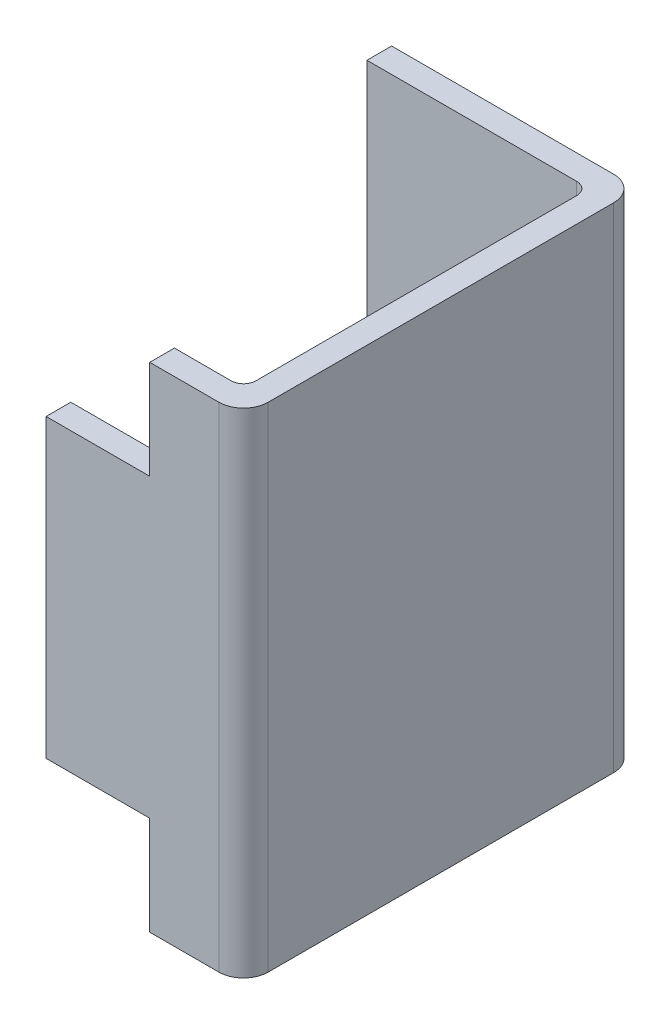
ISO-10303-21;
HEADER;
FILE_DESCRIPTION(('STEP AP214'),'2;1');
FILE_NAME('part.step','',(''),(''),'','','');
FILE_SCHEMA(('AUTOMOTIVE_DESIGN { 1 0 10303 214 1 1 1 1 }'));
ENDSEC;
DATA;
#1=APPLICATION_CONTEXT('core data for automotive mechanical design processes');
#2=APPLICATION_PROTOCOL_DEFINITION('international standard','automotive_design',2000,#1);
#3=PRODUCT_CONTEXT('',#1,'mechanical');
#4=PRODUCT('Part','Part','',(#3));
#5=PRODUCT_RELATED_PRODUCT_CATEGORY('part','',(#4));
#6=PRODUCT_DEFINITION_FORMATION('','',#4);
#7=PRODUCT_DEFINITION_CONTEXT('part definition',#1,'design');
#8=PRODUCT_DEFINITION('design','',#6,#7);
#9=PRODUCT_DEFINITION_SHAPE('','',#8);
#10=(LENGTH_UNIT() NAMED_UNIT(*) SI_UNIT(.MILLI.,.METRE.));
#11=(NAMED_UNIT(*) PLANE_ANGLE_UNIT() SI_UNIT($,.RADIAN.));
#12=(NAMED_UNIT(*) SI_UNIT($,.STERADIAN.) SOLID_ANGLE_UNIT());
#13=UNCERTAINTY_MEASURE_WITH_UNIT(LENGTH_MEASURE(1.E-05),#10,'distance_accuracy_value','');
#14=(GEOMETRIC_REPRESENTATION_CONTEXT(3) GLOBAL_UNCERTAINTY_ASSIGNED_CONTEXT((#13)) GLOBAL_UNIT_ASSIGNED_CONTEXT((#10,
#11,#12)) REPRESENTATION_CONTEXT('',''));
#15=CARTESIAN_POINT('',(0.,0.,0.));
#16=DIRECTION('',(0.,0.,1.));
#17=DIRECTION('',(1.,0.,0.));
#18=AXIS2_PLACEMENT_3D('',#15,#16,#17);
#19=CARTESIAN_POINT('',(0.475,0.,0.));
#20=DIRECTION('',(0.,0.,-1.));
#21=DIRECTION('',(-1.,0.,0.));
#22=AXIS2_PLACEMENT_3D('',#19,#20,#21);
#23=PLANE('',#22);
#24=DIRECTION('',(0.,1.,0.));
#25=VECTOR('',#24,1.);
#26=CARTESIAN_POINT('',(0.25,0.,0.));
#27=LINE('',#26,#25);
#28=CARTESIAN_POINT('',(0.25,-0.25,0.));
#29=VERTEX_POINT('',#28);
#30=CARTESIAN_POINT('',(0.25,0.25,0.));
#31=VERTEX_POINT('',#30);
#32=EDGE_CURVE('E11',#29,#31,#27,.T.);
#33=ORIENTED_EDGE('',*,*,#32,.T.);
#34=DIRECTION('',(-1.,0.,0.));
#35=VECTOR('',#34,1.);
#36=CARTESIAN_POINT('',(0.475,0.25,0.));
#37=LINE('',#36,#35);
#38=CARTESIAN_POINT('',(0.475,0.25,0.));
#39=VERTEX_POINT('',#38);
#40=EDGE_CURVE('E24',#39,#31,#37,.T.);
#41=ORIENTED_EDGE('',*,*,#40,.F.);
#42=DIRECTION('',(0.,-1.,0.));
#43=VECTOR('',#42,1.);
#44=CARTESIAN_POINT('',(0.475,0.,0.));
#45=LINE('',#44,#43);
#46=CARTESIAN_POINT('',(0.475,-0.25,0.));
#47=VERTEX_POINT('',#46);
#48=EDGE_CURVE('E259',#39,#47,#45,.T.);
#49=ORIENTED_EDGE('',*,*,#48,.T.);
#50=DIRECTION('',(1.,0.,0.));
#51=VECTOR('',#50,1.);
#52=CARTESIAN_POINT('',(0.475,-0.25,0.));
#53=LINE('',#52,#51);
#54=EDGE_CURVE('E256',#29,#47,#53,.T.);
#55=ORIENTED_EDGE('',*,*,#54,.F.);
#56=EDGE_LOOP('',(#33,#41,#49,#55));
#57=FACE_BOUND('',#56,.T.);
#58=ADVANCED_FACE('F17',(#57),#23,.T.);
#59=CARTESIAN_POINT('',(0.25,0.,0.));
#60=DIRECTION('',(-1.,0.,0.));
#61=DIRECTION('',(0.,0.,1.));
#62=AXIS2_PLACEMENT_3D('',#59,#60,#61);
#63=PLANE('',#62);
#64=DIRECTION('',(0.,1.,0.));
#65=VECTOR('',#64,1.);
#66=CARTESIAN_POINT('',(0.25,0.,0.0250000000116414));
#67=LINE('',#66,#65);
#68=CARTESIAN_POINT('',(0.25,-0.25,0.0250000000116414));
#69=VERTEX_POINT('',#68);
#70=CARTESIAN_POINT('',(0.25,0.25,0.0250000000116414));
#71=VERTEX_POINT('',#70);
#72=EDGE_CURVE('E254',#69,#71,#67,.T.);
#73=ORIENTED_EDGE('',*,*,#72,.T.);
#74=DIRECTION('',(0.,0.,1.));
#75=VECTOR('',#74,1.);
#76=CARTESIAN_POINT('',(0.25,0.25,0.));
#77=LINE('',#76,#75);
#78=EDGE_CURVE('E251',#31,#71,#77,.T.);
#79=ORIENTED_EDGE('',*,*,#78,.F.);
#80=ORIENTED_EDGE('',*,*,#32,.F.);
#81=DIRECTION('',(0.,0.,-1.));
#82=VECTOR('',#81,1.);
#83=CARTESIAN_POINT('',(0.25,-0.25,0.));
#84=LINE('',#83,#82);
#85=EDGE_CURVE('E248',#69,#29,#84,.T.);
#86=ORIENTED_EDGE('',*,*,#85,.F.);
#87=EDGE_LOOP('',(#73,#79,#80,#86));
#88=FACE_BOUND('',#87,.T.);
#89=ADVANCED_FACE('F265',(#88),#63,.T.);
#90=CARTESIAN_POINT('',(0.25,0.,0.0250000000116414));
#91=DIRECTION('',(0.,0.,1.));
#92=DIRECTION('',(1.,0.,0.));
#93=AXIS2_PLACEMENT_3D('',#90,#91,#92);
#94=PLANE('',#93);
#95=DIRECTION('',(0.,1.,0.));
#96=VECTOR('',#95,1.);
#97=CARTESIAN_POINT('',(0.46250000000291,0.,0.0250000000116413));
#98=LINE('',#97,#96);
#99=CARTESIAN_POINT('',(0.46250000000291,-0.25,0.0250000000116413));
#100=VERTEX_POINT('',#99);
#101=CARTESIAN_POINT('',(0.46250000000291,0.25,0.0250000000116413));
#102=VERTEX_POINT('',#101);
#103=EDGE_CURVE('E246',#100,#102,#98,.T.);
#104=ORIENTED_EDGE('',*,*,#103,.T.);
#105=DIRECTION('',(1.,0.,0.));
#106=VECTOR('',#105,1.);
#107=CARTESIAN_POINT('',(0.25,0.25,0.0250000000116414));
#108=LINE('',#107,#106);
#109=EDGE_CURVE('E243',#71,#102,#108,.T.);
#110=ORIENTED_EDGE('',*,*,#109,.F.);
#111=ORIENTED_EDGE('',*,*,#72,.F.);
#112=DIRECTION('',(-1.,0.,0.));
#113=VECTOR('',#112,1.);
#114=CARTESIAN_POINT('',(0.25,-0.25,0.0250000000116414));
#115=LINE('',#114,#113);
#116=EDGE_CURVE('E240',#100,#69,#115,.T.);
#117=ORIENTED_EDGE('',*,*,#116,.F.);
#118=EDGE_LOOP('',(#104,#110,#111,#117));
#119=FACE_BOUND('',#118,.T.);
#120=ADVANCED_FACE('F268',(#119),#94,.T.);
#121=CARTESIAN_POINT('',(0.46250000000291,0.,0.0375000000116413));
#122=DIRECTION('',(0.,1.,0.));
#123=DIRECTION('',(-1.,0.,0.));
#124=AXIS2_PLACEMENT_3D('',#121,#122,#123);
#125=CYLINDRICAL_SURFACE('',#124,0.0125);
#126=DIRECTION('',(0.,1.,0.));
#127=VECTOR('',#126,1.);
#128=CARTESIAN_POINT('',(0.47500000000291,0.,0.0375000000116413));
#129=LINE('',#128,#127);
#130=CARTESIAN_POINT('',(0.47500000000291,-0.25,0.0375000000116413));
#131=VERTEX_POINT('',#130);
#132=CARTESIAN_POINT('',(0.47500000000291,0.25,0.0375000000116413));
#133=VERTEX_POINT('',#132);
#134=EDGE_CURVE('E237',#131,#133,#129,.T.);
#135=ORIENTED_EDGE('',*,*,#134,.T.);
#136=CARTESIAN_POINT('',(0.46250000000291,0.25,0.0375000000116413));
#137=DIRECTION('',(0.,-1.,0.));
#138=DIRECTION('',(-1.,0.,0.));
#139=AXIS2_PLACEMENT_3D('',#136,#137,#138);
#140=CIRCLE('',#139,0.0125);
#141=EDGE_CURVE('E235',#102,#133,#140,.T.);
#142=ORIENTED_EDGE('',*,*,#141,.F.);
#143=ORIENTED_EDGE('',*,*,#103,.F.);
#144=CARTESIAN_POINT('',(0.46250000000291,-0.25,0.0375000000116413));
#145=DIRECTION('',(0.,1.,0.));
#146=DIRECTION('',(-1.,0.,0.));
#147=AXIS2_PLACEMENT_3D('',#144,#145,#146);
#148=CIRCLE('',#147,0.0125);
#149=EDGE_CURVE('E232',#131,#100,#148,.T.);
#150=ORIENTED_EDGE('',*,*,#149,.F.);
#151=EDGE_LOOP('',(#135,#142,#143,#150));
#152=FACE_BOUND('',#151,.T.);
#153=ADVANCED_FACE('F271',(#152),#125,.F.);
#154=CARTESIAN_POINT('',(0.47500000000291,0.,0.0375000000116413));
#155=DIRECTION('',(-1.,0.,0.));
#156=DIRECTION('',(0.,0.,1.));
#157=AXIS2_PLACEMENT_3D('',#154,#155,#156);
#158=PLANE('',#157);
#159=DIRECTION('',(0.,1.,0.));
#160=VECTOR('',#159,1.);
#161=CARTESIAN_POINT('',(0.475000000002911,0.,0.362500000029104));
#162=LINE('',#161,#160);
#163=CARTESIAN_POINT('',(0.475000000002911,-0.25,0.362500000029104));
#164=VERTEX_POINT('',#163);
#165=CARTESIAN_POINT('',(0.475000000002911,0.25,0.362500000029104));
#166=VERTEX_POINT('',#165);
#167=EDGE_CURVE('E230',#164,#166,#162,.T.);
#168=ORIENTED_EDGE('',*,*,#167,.T.);
#169=DIRECTION('',(0.,0.,1.));
#170=VECTOR('',#169,1.);
#171=CARTESIAN_POINT('',(0.47500000000291,0.25,0.0375000000116413));
#172=LINE('',#171,#170);
#173=EDGE_CURVE('E227',#133,#166,#172,.T.);
#174=ORIENTED_EDGE('',*,*,#173,.F.);
#175=ORIENTED_EDGE('',*,*,#134,.F.);
#176=DIRECTION('',(0.,0.,-1.));
#177=VECTOR('',#176,1.);
#178=CARTESIAN_POINT('',(0.47500000000291,-0.25,0.0375000000116413));
#179=LINE('',#178,#177);
#180=EDGE_CURVE('E224',#164,#131,#179,.T.);
#181=ORIENTED_EDGE('',*,*,#180,.F.);
#182=EDGE_LOOP('',(#168,#174,#175,#181));
#183=FACE_BOUND('',#182,.T.);
#184=ADVANCED_FACE('F276',(#183),#158,.T.);
#185=CARTESIAN_POINT('',(0.46250000000291,0.,0.362500000029104));
#186=DIRECTION('',(0.,1.,0.));
#187=DIRECTION('',(0.,0.,-1.));
#188=AXIS2_PLACEMENT_3D('',#185,#186,#187);
#189=CYLINDRICAL_SURFACE('',#188,0.0125);
#190=DIRECTION('',(0.,1.,0.));
#191=VECTOR('',#190,1.);
#192=CARTESIAN_POINT('',(0.46250000000291,0.,0.375000000029104));
#193=LINE('',#192,#191);
#194=CARTESIAN_POINT('',(0.46250000000291,-0.25,0.375000000029104));
#195=VERTEX_POINT('',#194);
#196=CARTESIAN_POINT('',(0.46250000000291,0.25,0.375000000029104));
#197=VERTEX_POINT('',#196);
#198=EDGE_CURVE('E221',#195,#197,#193,.T.);
#199=ORIENTED_EDGE('',*,*,#198,.T.);
#200=CARTESIAN_POINT('',(0.46250000000291,0.25,0.362500000029104));
#201=DIRECTION('',(0.,-1.,0.));
#202=DIRECTION('',(0.,0.,-1.));
#203=AXIS2_PLACEMENT_3D('',#200,#201,#202);
#204=CIRCLE('',#203,0.0125);
#205=EDGE_CURVE('E219',#166,#197,#204,.T.);
#206=ORIENTED_EDGE('',*,*,#205,.F.);
#207=ORIENTED_EDGE('',*,*,#167,.F.);
#208=CARTESIAN_POINT('',(0.46250000000291,-0.25,0.362500000029104));
#209=DIRECTION('',(0.,1.,0.));
#210=DIRECTION('',(0.,0.,-1.));
#211=AXIS2_PLACEMENT_3D('',#208,#209,#210);
#212=CIRCLE('',#211,0.0125);
#213=EDGE_CURVE('E216',#195,#164,#212,.T.);
#214=ORIENTED_EDGE('',*,*,#213,.F.);
#215=EDGE_LOOP('',(#199,#206,#207,#214));
#216=FACE_BOUND('',#215,.T.);
#217=ADVANCED_FACE('F279',(#216),#189,.F.);
#218=CARTESIAN_POINT('',(0.475,0.,0.375));
#219=DIRECTION('',(0.,1.,0.));
#220=DIRECTION('',(0.,0.,1.));
#221=AXIS2_PLACEMENT_3D('',#218,#219,#220);
#222=CYLINDRICAL_SURFACE('',#221,0.0250000000000002);
#223=DIRECTION('',(0.,1.,0.));
#224=VECTOR('',#223,1.);
#225=CARTESIAN_POINT('',(0.5,0.,0.375));
#226=LINE('',#225,#224);
#227=CARTESIAN_POINT('',(0.5,-0.25,0.375));
#228=VERTEX_POINT('',#227);
#229=CARTESIAN_POINT('',(0.5,0.25,0.375));
#230=VERTEX_POINT('',#229);
#231=EDGE_CURVE('E214',#228,#230,#226,.T.);
#232=ORIENTED_EDGE('',*,*,#231,.T.);
#233=CARTESIAN_POINT('',(0.475,0.25,0.375));
#234=DIRECTION('',(0.,1.,0.));
#235=DIRECTION('',(0.,0.,1.));
#236=AXIS2_PLACEMENT_3D('',#233,#234,#235);
#237=CIRCLE('',#236,0.0250000000000002);
#238=CARTESIAN_POINT('',(0.475,0.25,0.4));
#239=VERTEX_POINT('',#238);
#240=EDGE_CURVE('E211',#239,#230,#237,.T.);
#241=ORIENTED_EDGE('',*,*,#240,.F.);
#242=DIRECTION('',(0.,1.,0.));
#243=VECTOR('',#242,1.);
#244=CARTESIAN_POINT('',(0.475,0.,0.4));
#245=LINE('',#244,#243);
#246=CARTESIAN_POINT('',(0.475,-0.25,0.4));
#247=VERTEX_POINT('',#246);
#248=EDGE_CURVE('E208',#247,#239,#245,.T.);
#249=ORIENTED_EDGE('',*,*,#248,.F.);
#250=CARTESIAN_POINT('',(0.475,-0.25,0.375));
#251=DIRECTION('',(0.,-1.,0.));
#252=DIRECTION('',(0.,0.,1.));
#253=AXIS2_PLACEMENT_3D('',#250,#251,#252);
#254=CIRCLE('',#253,0.0250000000000002);
#255=EDGE_CURVE('E205',#228,#247,#254,.T.);
#256=ORIENTED_EDGE('',*,*,#255,.F.);
#257=EDGE_LOOP('',(#232,#241,#249,#256));
#258=FACE_BOUND('',#257,.T.);
#259=ADVANCED_FACE('F301',(#258),#222,.T.);
#260=CARTESIAN_POINT('',(0.5,0.,0.375));
#261=DIRECTION('',(1.,0.,0.));
#262=DIRECTION('',(0.,0.,-1.));
#263=AXIS2_PLACEMENT_3D('',#260,#261,#262);
#264=PLANE('',#263);
#265=DIRECTION('',(0.,1.,0.));
#266=VECTOR('',#265,1.);
#267=CARTESIAN_POINT('',(0.5,0.,0.0249999999999997));
#268=LINE('',#267,#266);
#269=CARTESIAN_POINT('',(0.5,-0.25,0.0249999999999997));
#270=VERTEX_POINT('',#269);
#271=CARTESIAN_POINT('',(0.5,0.25,0.0249999999999997));
#272=VERTEX_POINT('',#271);
#273=EDGE_CURVE('E203',#270,#272,#268,.T.);
#274=ORIENTED_EDGE('',*,*,#273,.T.);
#275=DIRECTION('',(0.,0.,-1.));
#276=VECTOR('',#275,1.);
#277=CARTESIAN_POINT('',(0.5,0.25,0.375));
#278=LINE('',#277,#276);
#279=EDGE_CURVE('E200',#230,#272,#278,.T.);
#280=ORIENTED_EDGE('',*,*,#279,.F.);
#281=ORIENTED_EDGE('',*,*,#231,.F.);
#282=DIRECTION('',(0.,0.,1.));
#283=VECTOR('',#282,1.);
#284=CARTESIAN_POINT('',(0.5,-0.25,0.375));
#285=LINE('',#284,#283);
#286=EDGE_CURVE('E197',#270,#228,#285,.T.);
#287=ORIENTED_EDGE('',*,*,#286,.F.);
#288=EDGE_LOOP('',(#274,#280,#281,#287));
#289=FACE_BOUND('',#288,.T.);
#290=ADVANCED_FACE('F304',(#289),#264,.T.);
#291=CARTESIAN_POINT('',(0.475,0.,0.0249999999999998));
#292=DIRECTION('',(0.,1.,0.));
#293=DIRECTION('',(1.,0.,0.));
#294=AXIS2_PLACEMENT_3D('',#291,#292,#293);
#295=CYLINDRICAL_SURFACE('',#294,0.0249999999999999);
#296=ORIENTED_EDGE('',*,*,#48,.F.);
#297=CARTESIAN_POINT('',(0.475,0.25,0.0249999999999998));
#298=DIRECTION('',(0.,1.,0.));
#299=DIRECTION('',(1.,0.,0.));
#300=AXIS2_PLACEMENT_3D('',#297,#298,#299);
#301=CIRCLE('',#300,0.0249999999999999);
#302=EDGE_CURVE('E194',#272,#39,#301,.T.);
#303=ORIENTED_EDGE('',*,*,#302,.F.);
#304=ORIENTED_EDGE('',*,*,#273,.F.);
#305=CARTESIAN_POINT('',(0.475,-0.25,0.0249999999999998));
#306=DIRECTION('',(0.,-1.,0.));
#307=DIRECTION('',(1.,0.,0.));
#308=AXIS2_PLACEMENT_3D('',#305,#306,#307);
#309=CIRCLE('',#308,0.0249999999999999);
#310=EDGE_CURVE('E191',#47,#270,#309,.T.);
#311=ORIENTED_EDGE('',*,*,#310,.F.);
#312=EDGE_LOOP('',(#296,#303,#304,#311));
#313=FACE_BOUND('',#312,.T.);
#314=ADVANCED_FACE('F307',(#313),#295,.T.);
#315=CARTESIAN_POINT('',(0.375,-0.25,0.2));
#316=DIRECTION('',(0.,1.,0.));
#317=DIRECTION('',(0.,0.,1.));
#318=AXIS2_PLACEMENT_3D('',#315,#316,#317);
#319=PLANE('',#318);
#320=DIRECTION('',(0.,0.,-1.));
#321=VECTOR('',#320,1.);
#322=CARTESIAN_POINT('',(0.404981821047639,-0.25,0.3));
#323=LINE('',#322,#321);
#324=CARTESIAN_POINT('',(0.404981821047639,-0.25,0.4));
#325=VERTEX_POINT('',#324);
#326=CARTESIAN_POINT('',(0.404981821047639,-0.25,0.375));
#327=VERTEX_POINT('',#326);
#328=EDGE_CURVE('E189',#325,#327,#323,.T.);
#329=ORIENTED_EDGE('',*,*,#328,.T.);
#330=DIRECTION('',(1.,0.,0.));
#331=VECTOR('',#330,1.);
#332=CARTESIAN_POINT('',(0.46250000000291,-0.25,0.375000000029104));
#333=LINE('',#332,#331);
#334=EDGE_CURVE('E134',#327,#195,#333,.T.);
#335=ORIENTED_EDGE('',*,*,#334,.T.);
#336=ORIENTED_EDGE('',*,*,#213,.T.);
#337=ORIENTED_EDGE('',*,*,#180,.T.);
#338=ORIENTED_EDGE('',*,*,#149,.T.);
#339=ORIENTED_EDGE('',*,*,#116,.T.);
#340=ORIENTED_EDGE('',*,*,#85,.T.);
#341=ORIENTED_EDGE('',*,*,#54,.T.);
#342=ORIENTED_EDGE('',*,*,#310,.T.);
#343=ORIENTED_EDGE('',*,*,#286,.T.);
#344=ORIENTED_EDGE('',*,*,#255,.T.);
#345=DIRECTION('',(-1.,0.,0.));
#346=VECTOR('',#345,1.);
#347=CARTESIAN_POINT('',(0.3,-0.25,0.4));
#348=LINE('',#347,#346);
#349=EDGE_CURVE('E185',#247,#325,#348,.T.);
#350=ORIENTED_EDGE('',*,*,#349,.T.);
#351=EDGE_LOOP('',(#329,#335,#336,#337,#338,#339,#340,#341,#342,#343,#344,#350));
#352=FACE_BOUND('',#351,.T.);
#353=ADVANCED_FACE('F297',(#352),#319,.F.);
#354=CARTESIAN_POINT('',(0.3,0.,0.4));
#355=DIRECTION('',(0.,0.,1.));
#356=DIRECTION('',(1.,0.,0.));
#357=AXIS2_PLACEMENT_3D('',#354,#355,#356);
#358=PLANE('',#357);
#359=DIRECTION('',(0.,-1.,0.));
#360=VECTOR('',#359,1.);
#361=CARTESIAN_POINT('',(0.404981821047639,-0.175,0.4));
#362=LINE('',#361,#360);
#363=CARTESIAN_POINT('',(0.404981821047639,-0.15,0.4));
#364=VERTEX_POINT('',#363);
#365=EDGE_CURVE('E150',#364,#325,#362,.T.);
#366=ORIENTED_EDGE('',*,*,#365,.T.);
#367=ORIENTED_EDGE('',*,*,#349,.F.);
#368=ORIENTED_EDGE('',*,*,#248,.T.);
#369=DIRECTION('',(1.,0.,0.));
#370=VECTOR('',#369,1.);
#371=CARTESIAN_POINT('',(0.3,0.25,0.4));
#372=LINE('',#371,#370);
#373=CARTESIAN_POINT('',(0.404981821047639,0.25,0.4));
#374=VERTEX_POINT('',#373);
#375=EDGE_CURVE('E181',#374,#239,#372,.T.);
#376=ORIENTED_EDGE('',*,*,#375,.F.);
#377=DIRECTION('',(0.,-1.,0.));
#378=VECTOR('',#377,1.);
#379=CARTESIAN_POINT('',(0.404981821047639,0.175,0.4));
#380=LINE('',#379,#378);
#381=CARTESIAN_POINT('',(0.404981821047639,0.15,0.4));
#382=VERTEX_POINT('',#381);
#383=EDGE_CURVE('E179',#374,#382,#380,.T.);
#384=ORIENTED_EDGE('',*,*,#383,.T.);
#385=DIRECTION('',(-1.,0.,0.));
#386=VECTOR('',#385,1.);
#387=CARTESIAN_POINT('',(0.35249091052382,0.15,0.4));
#388=LINE('',#387,#386);
#389=CARTESIAN_POINT('',(0.3,0.15,0.4));
#390=VERTEX_POINT('',#389);
#391=EDGE_CURVE('E177',#382,#390,#388,.T.);
#392=ORIENTED_EDGE('',*,*,#391,.T.);
#393=DIRECTION('',(0.,1.,0.));
#394=VECTOR('',#393,1.);
#395=CARTESIAN_POINT('',(0.3,0.,0.4));
#396=LINE('',#395,#394);
#397=CARTESIAN_POINT('',(0.3,-0.15,0.4));
#398=VERTEX_POINT('',#397);
#399=EDGE_CURVE('E174',#398,#390,#396,.T.);
#400=ORIENTED_EDGE('',*,*,#399,.F.);
#401=DIRECTION('',(1.,0.,0.));
#402=VECTOR('',#401,1.);
#403=CARTESIAN_POINT('',(0.35249091052382,-0.15,0.4));
#404=LINE('',#403,#402);
#405=EDGE_CURVE('E172',#398,#364,#404,.T.);
#406=ORIENTED_EDGE('',*,*,#405,.T.);
#407=EDGE_LOOP('',(#366,#367,#368,#376,#384,#392,#400,#406));
#408=FACE_BOUND('',#407,.T.);
#409=ADVANCED_FACE('F288',(#408),#358,.T.);
#410=CARTESIAN_POINT('',(0.375,0.25,0.2));
#411=DIRECTION('',(0.,1.,0.));
#412=DIRECTION('',(0.,0.,1.));
#413=AXIS2_PLACEMENT_3D('',#410,#411,#412);
#414=PLANE('',#413);
#415=DIRECTION('',(0.,0.,1.));
#416=VECTOR('',#415,1.);
#417=CARTESIAN_POINT('',(0.404981821047639,0.25,0.3));
#418=LINE('',#417,#416);
#419=CARTESIAN_POINT('',(0.404981821047639,0.25,0.375000000029104));
#420=VERTEX_POINT('',#419);
#421=EDGE_CURVE('E169',#420,#374,#418,.T.);
#422=ORIENTED_EDGE('',*,*,#421,.T.);
#423=ORIENTED_EDGE('',*,*,#375,.T.);
#424=ORIENTED_EDGE('',*,*,#240,.T.);
#425=ORIENTED_EDGE('',*,*,#279,.T.);
#426=ORIENTED_EDGE('',*,*,#302,.T.);
#427=ORIENTED_EDGE('',*,*,#40,.T.);
#428=ORIENTED_EDGE('',*,*,#78,.T.);
#429=ORIENTED_EDGE('',*,*,#109,.T.);
#430=ORIENTED_EDGE('',*,*,#141,.T.);
#431=ORIENTED_EDGE('',*,*,#173,.T.);
#432=ORIENTED_EDGE('',*,*,#205,.T.);
#433=DIRECTION('',(-1.,0.,0.));
#434=VECTOR('',#433,1.);
#435=CARTESIAN_POINT('',(0.46250000000291,0.25,0.375000000029104));
#436=LINE('',#435,#434);
#437=EDGE_CURVE('E166',#197,#420,#436,.T.);
#438=ORIENTED_EDGE('',*,*,#437,.T.);
#439=EDGE_LOOP('',(#422,#423,#424,#425,#426,#427,#428,#429,#430,#431,#432,#438));
#440=FACE_BOUND('',#439,.T.);
#441=ADVANCED_FACE('F261',(#440),#414,.T.);
#442=CARTESIAN_POINT('',(0.404981821047639,0.15,0.4));
#443=DIRECTION('',(0.,-1.,0.));
#444=DIRECTION('',(-1.,0.,0.));
#445=AXIS2_PLACEMENT_3D('',#442,#443,#444);
#446=PLANE('',#445);
#447=DIRECTION('',(0.,0.,-1.));
#448=VECTOR('',#447,1.);
#449=CARTESIAN_POINT('',(0.3,0.15,0.387500000014552));
#450=LINE('',#449,#448);
#451=CARTESIAN_POINT('',(0.3,0.15,0.375));
#452=VERTEX_POINT('',#451);
#453=EDGE_CURVE('E164',#390,#452,#450,.T.);
#454=ORIENTED_EDGE('',*,*,#453,.F.);
#455=ORIENTED_EDGE('',*,*,#391,.F.);
#456=DIRECTION('',(0.,0.,-1.));
#457=VECTOR('',#456,1.);
#458=CARTESIAN_POINT('',(0.404981821047639,0.15,0.4));
#459=LINE('',#458,#457);
#460=CARTESIAN_POINT('',(0.404981821047639,0.15,0.375));
#461=VERTEX_POINT('',#460);
#462=EDGE_CURVE('E162',#382,#461,#459,.T.);
#463=ORIENTED_EDGE('',*,*,#462,.T.);
#464=DIRECTION('',(1.,0.,0.));
#465=VECTOR('',#464,1.);
#466=CARTESIAN_POINT('',(0.433740910525275,0.15,0.375000000029104));
#467=LINE('',#466,#465);
#468=EDGE_CURVE('E159',#452,#461,#467,.T.);
#469=ORIENTED_EDGE('',*,*,#468,.F.);
#470=EDGE_LOOP('',(#454,#455,#463,#469));
#471=FACE_BOUND('',#470,.T.);
#472=ADVANCED_FACE('F291',(#471),#446,.F.);
#473=CARTESIAN_POINT('',(0.404981821047639,0.35,0.4));
#474=DIRECTION('',(1.,0.,0.));
#475=DIRECTION('',(0.,-1.,0.));
#476=AXIS2_PLACEMENT_3D('',#473,#474,#475);
#477=PLANE('',#476);
#478=ORIENTED_EDGE('',*,*,#421,.F.);
#479=DIRECTION('',(0.,1.,0.));
#480=VECTOR('',#479,1.);
#481=CARTESIAN_POINT('',(0.404981821047639,0.175,0.375000000029104));
#482=LINE('',#481,#480);
#483=EDGE_CURVE('E156',#461,#420,#482,.T.);
#484=ORIENTED_EDGE('',*,*,#483,.F.);
#485=ORIENTED_EDGE('',*,*,#462,.F.);
#486=ORIENTED_EDGE('',*,*,#383,.F.);
#487=EDGE_LOOP('',(#478,#484,#485,#486));
#488=FACE_BOUND('',#487,.T.);
#489=ADVANCED_FACE('F284',(#488),#477,.F.);
#490=CARTESIAN_POINT('',(0.3,0.,0.375000000029104));
#491=DIRECTION('',(-1.,0.,0.));
#492=DIRECTION('',(0.,0.,1.));
#493=AXIS2_PLACEMENT_3D('',#490,#491,#492);
#494=PLANE('',#493);
#495=DIRECTION('',(0.,0.,1.));
#496=VECTOR('',#495,1.);
#497=CARTESIAN_POINT('',(0.3,-0.15,0.387500000014552));
#498=LINE('',#497,#496);
#499=CARTESIAN_POINT('',(0.3,-0.15,0.375));
#500=VERTEX_POINT('',#499);
#501=EDGE_CURVE('E145',#500,#398,#498,.T.);
#502=ORIENTED_EDGE('',*,*,#501,.T.);
#503=ORIENTED_EDGE('',*,*,#399,.T.);
#504=ORIENTED_EDGE('',*,*,#453,.T.);
#505=DIRECTION('',(0.,1.,0.));
#506=VECTOR('',#505,1.);
#507=CARTESIAN_POINT('',(0.3,0.,0.375000000029104));
#508=LINE('',#507,#506);
#509=EDGE_CURVE('E137',#500,#452,#508,.T.);
#510=ORIENTED_EDGE('',*,*,#509,.F.);
#511=EDGE_LOOP('',(#502,#503,#504,#510));
#512=FACE_BOUND('',#511,.T.);
#513=ADVANCED_FACE('F294',(#512),#494,.T.);
#514=CARTESIAN_POINT('',(0.46250000000291,0.,0.375000000029104));
#515=DIRECTION('',(0.,0.,-1.));
#516=DIRECTION('',(-1.,0.,0.));
#517=AXIS2_PLACEMENT_3D('',#514,#515,#516);
#518=PLANE('',#517);
#519=DIRECTION('',(0.,1.,0.));
#520=VECTOR('',#519,1.);
#521=CARTESIAN_POINT('',(0.404981821047639,-0.175,0.375000000029104));
#522=LINE('',#521,#520);
#523=CARTESIAN_POINT('',(0.404981821047639,-0.15,0.375));
#524=VERTEX_POINT('',#523);
#525=EDGE_CURVE('E127',#327,#524,#522,.T.);
#526=ORIENTED_EDGE('',*,*,#525,.T.);
#527=DIRECTION('',(-1.,0.,0.));
#528=VECTOR('',#527,1.);
#529=CARTESIAN_POINT('',(0.433740910525275,-0.15,0.375000000029104));
#530=LINE('',#529,#528);
#531=EDGE_CURVE('E131',#524,#500,#530,.T.);
#532=ORIENTED_EDGE('',*,*,#531,.T.);
#533=ORIENTED_EDGE('',*,*,#509,.T.);
#534=ORIENTED_EDGE('',*,*,#468,.T.);
#535=ORIENTED_EDGE('',*,*,#483,.T.);
#536=ORIENTED_EDGE('',*,*,#437,.F.);
#537=ORIENTED_EDGE('',*,*,#198,.F.);
#538=ORIENTED_EDGE('',*,*,#334,.F.);
#539=EDGE_LOOP('',(#526,#532,#533,#534,#535,#536,#537,#538));
#540=FACE_BOUND('',#539,.T.);
#541=ADVANCED_FACE('F129',(#540),#518,.T.);
#542=CARTESIAN_POINT('',(0.404981821047639,-0.35,0.4));
#543=DIRECTION('',(-1.,0.,0.));
#544=DIRECTION('',(0.,1.,0.));
#545=AXIS2_PLACEMENT_3D('',#542,#543,#544);
#546=PLANE('',#545);
#547=ORIENTED_EDGE('',*,*,#328,.F.);
#548=ORIENTED_EDGE('',*,*,#365,.F.);
#549=DIRECTION('',(0.,0.,-1.));
#550=VECTOR('',#549,1.);
#551=CARTESIAN_POINT('',(0.404981821047639,-0.15,0.4));
#552=LINE('',#551,#550);
#553=EDGE_CURVE('E143',#364,#524,#552,.T.);
#554=ORIENTED_EDGE('',*,*,#553,.T.);
#555=ORIENTED_EDGE('',*,*,#525,.F.);
#556=EDGE_LOOP('',(#547,#548,#554,#555));
#557=FACE_BOUND('',#556,.T.);
#558=ADVANCED_FACE('F148',(#557),#546,.T.);
#559=CARTESIAN_POINT('',(0.404981821047639,-0.15,0.4));
#560=DIRECTION('',(0.,-1.,0.));
#561=DIRECTION('',(-1.,0.,0.));
#562=AXIS2_PLACEMENT_3D('',#559,#560,#561);
#563=PLANE('',#562);
#564=ORIENTED_EDGE('',*,*,#501,.F.);
#565=ORIENTED_EDGE('',*,*,#531,.F.);
#566=ORIENTED_EDGE('',*,*,#553,.F.);
#567=ORIENTED_EDGE('',*,*,#405,.F.);
#568=EDGE_LOOP('',(#564,#565,#566,#567));
#569=FACE_BOUND('',#568,.T.);
#570=ADVANCED_FACE('F141',(#569),#563,.T.);
#571=CLOSED_SHELL('',(#58,#89,#120,#153,#184,#217,#259,#290,#314,#353,#409,#441,#472,#489,#513,
#541,#558,#570));
#572=MANIFOLD_SOLID_BREP('B1',#571);
#573=ADVANCED_BREP_SHAPE_REPRESENTATION('',(#18,#572),#14);
#574=SHAPE_DEFINITION_REPRESENTATION(#9,#573);
ENDSEC;
END-ISO-10303-21;
